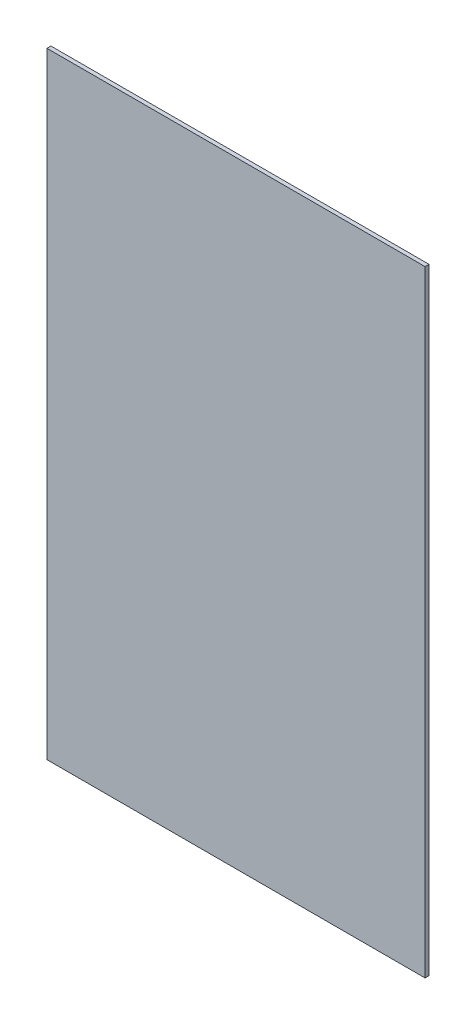
ISO-10303-21;
HEADER;
FILE_DESCRIPTION(('STEP AP214'),'2;1');
FILE_NAME('part.step','',(''),(''),'','','');
FILE_SCHEMA(('AUTOMOTIVE_DESIGN { 1 0 10303 214 1 1 1 1 }'));
ENDSEC;
DATA;
#1=APPLICATION_CONTEXT('core data for automotive mechanical design processes');
#2=APPLICATION_PROTOCOL_DEFINITION('international standard','automotive_design',2000,#1);
#3=PRODUCT_CONTEXT('',#1,'mechanical');
#4=PRODUCT('Part','Part','',(#3));
#5=PRODUCT_RELATED_PRODUCT_CATEGORY('part','',(#4));
#6=PRODUCT_DEFINITION_FORMATION('','',#4);
#7=PRODUCT_DEFINITION_CONTEXT('part definition',#1,'design');
#8=PRODUCT_DEFINITION('design','',#6,#7);
#9=PRODUCT_DEFINITION_SHAPE('','',#8);
#10=(LENGTH_UNIT() NAMED_UNIT(*) SI_UNIT(.MILLI.,.METRE.));
#11=(NAMED_UNIT(*) PLANE_ANGLE_UNIT() SI_UNIT($,.RADIAN.));
#12=(NAMED_UNIT(*) SI_UNIT($,.STERADIAN.) SOLID_ANGLE_UNIT());
#13=UNCERTAINTY_MEASURE_WITH_UNIT(LENGTH_MEASURE(1.E-05),#10,'distance_accuracy_value','');
#14=(GEOMETRIC_REPRESENTATION_CONTEXT(3) GLOBAL_UNCERTAINTY_ASSIGNED_CONTEXT((#13)) GLOBAL_UNIT_ASSIGNED_CONTEXT((#10,
#11,#12)) REPRESENTATION_CONTEXT('',''));
#15=CARTESIAN_POINT('',(0.,0.,0.));
#16=DIRECTION('',(0.,0.,1.));
#17=DIRECTION('',(1.,0.,0.));
#18=AXIS2_PLACEMENT_3D('',#15,#16,#17);
#19=CARTESIAN_POINT('',(-67.5540639585563,66.6562573789846,3.));
#20=DIRECTION('',(1.,0.,0.));
#21=DIRECTION('',(0.,1.,0.));
#22=AXIS2_PLACEMENT_3D('',#19,#20,#21);
#23=PLANE('',#22);
#24=DIRECTION('',(0.,-1.,0.));
#25=VECTOR('',#24,1.);
#26=CARTESIAN_POINT('',(-67.5540639585563,66.6562573789846,0.));
#27=LINE('',#26,#25);
#28=CARTESIAN_POINT('',(-67.5540639585563,66.6562573789846,0.));
#29=VERTEX_POINT('',#28);
#30=CARTESIAN_POINT('',(-67.5540639585562,-399.343742621015,0.));
#31=VERTEX_POINT('',#30);
#32=EDGE_CURVE('E96',#29,#31,#27,.T.);
#33=ORIENTED_EDGE('',*,*,#32,.T.);
#34=DIRECTION('',(0.,0.,-1.));
#35=VECTOR('',#34,1.);
#36=CARTESIAN_POINT('',(-67.5540639585562,-399.343742621015,3.));
#37=LINE('',#36,#35);
#38=CARTESIAN_POINT('',(-67.5540639585562,-399.343742621015,3.));
#39=VERTEX_POINT('',#38);
#40=EDGE_CURVE('E11',#39,#31,#37,.T.);
#41=ORIENTED_EDGE('',*,*,#40,.F.);
#42=DIRECTION('',(0.,-1.,0.));
#43=VECTOR('',#42,1.);
#44=CARTESIAN_POINT('',(-67.5540639585563,66.6562573789846,3.));
#45=LINE('',#44,#43);
#46=CARTESIAN_POINT('',(-67.5540639585563,66.6562573789846,3.));
#47=VERTEX_POINT('',#46);
#48=EDGE_CURVE('E84',#47,#39,#45,.T.);
#49=ORIENTED_EDGE('',*,*,#48,.F.);
#50=DIRECTION('',(0.,0.,-1.));
#51=VECTOR('',#50,1.);
#52=CARTESIAN_POINT('',(-67.5540639585563,66.6562573789846,3.));
#53=LINE('',#52,#51);
#54=EDGE_CURVE('E92',#47,#29,#53,.T.);
#55=ORIENTED_EDGE('',*,*,#54,.T.);
#56=EDGE_LOOP('',(#33,#41,#49,#55));
#57=FACE_BOUND('',#56,.T.);
#58=ADVANCED_FACE('F33',(#57),#23,.F.);
#59=CARTESIAN_POINT('',(-67.5540639585562,-399.343742621015,3.));
#60=DIRECTION('',(0.,1.,0.));
#61=DIRECTION('',(0.,0.,1.));
#62=AXIS2_PLACEMENT_3D('',#59,#60,#61);
#63=PLANE('',#62);
#64=DIRECTION('',(1.,0.,0.));
#65=VECTOR('',#64,1.);
#66=CARTESIAN_POINT('',(-67.5540639585562,-399.343742621015,0.));
#67=LINE('',#66,#65);
#68=CARTESIAN_POINT('',(218.445936041444,-399.343742621015,0.));
#69=VERTEX_POINT('',#68);
#70=EDGE_CURVE('E88',#31,#69,#67,.T.);
#71=ORIENTED_EDGE('',*,*,#70,.T.);
#72=DIRECTION('',(0.,0.,-1.));
#73=VECTOR('',#72,1.);
#74=CARTESIAN_POINT('',(218.445936041444,-399.343742621015,3.));
#75=LINE('',#74,#73);
#76=CARTESIAN_POINT('',(218.445936041444,-399.343742621015,3.));
#77=VERTEX_POINT('',#76);
#78=EDGE_CURVE('E41',#77,#69,#75,.T.);
#79=ORIENTED_EDGE('',*,*,#78,.F.);
#80=DIRECTION('',(1.,0.,0.));
#81=VECTOR('',#80,1.);
#82=CARTESIAN_POINT('',(-67.5540639585562,-399.343742621015,3.));
#83=LINE('',#82,#81);
#84=EDGE_CURVE('E79',#39,#77,#83,.T.);
#85=ORIENTED_EDGE('',*,*,#84,.F.);
#86=ORIENTED_EDGE('',*,*,#40,.T.);
#87=EDGE_LOOP('',(#71,#79,#85,#86));
#88=FACE_BOUND('',#87,.T.);
#89=ADVANCED_FACE('F87',(#88),#63,.F.);
#90=CARTESIAN_POINT('',(218.445936041444,66.6562573789846,3.));
#91=DIRECTION('',(-1.,0.,0.));
#92=DIRECTION('',(0.,-1.,0.));
#93=AXIS2_PLACEMENT_3D('',#90,#91,#92);
#94=PLANE('',#93);
#95=DIRECTION('',(0.,1.,0.));
#96=VECTOR('',#95,1.);
#97=CARTESIAN_POINT('',(218.445936041444,66.6562573789846,0.));
#98=LINE('',#97,#96);
#99=CARTESIAN_POINT('',(218.445936041444,66.6562573789846,0.));
#100=VERTEX_POINT('',#99);
#101=EDGE_CURVE('E66',#69,#100,#98,.T.);
#102=ORIENTED_EDGE('',*,*,#101,.T.);
#103=DIRECTION('',(0.,0.,-1.));
#104=VECTOR('',#103,1.);
#105=CARTESIAN_POINT('',(218.445936041444,66.6562573789846,3.));
#106=LINE('',#105,#104);
#107=CARTESIAN_POINT('',(218.445936041444,66.6562573789846,3.));
#108=VERTEX_POINT('',#107);
#109=EDGE_CURVE('E89',#108,#100,#106,.T.);
#110=ORIENTED_EDGE('',*,*,#109,.F.);
#111=DIRECTION('',(0.,1.,0.));
#112=VECTOR('',#111,1.);
#113=CARTESIAN_POINT('',(218.445936041444,66.6562573789846,3.));
#114=LINE('',#113,#112);
#115=EDGE_CURVE('E82',#77,#108,#114,.T.);
#116=ORIENTED_EDGE('',*,*,#115,.F.);
#117=ORIENTED_EDGE('',*,*,#78,.T.);
#118=EDGE_LOOP('',(#102,#110,#116,#117));
#119=FACE_BOUND('',#118,.T.);
#120=ADVANCED_FACE('F90',(#119),#94,.F.);
#121=CARTESIAN_POINT('',(-67.5540639585563,66.6562573789846,3.));
#122=DIRECTION('',(0.,-1.,0.));
#123=DIRECTION('',(0.,0.,-1.));
#124=AXIS2_PLACEMENT_3D('',#121,#122,#123);
#125=PLANE('',#124);
#126=DIRECTION('',(-1.,0.,0.));
#127=VECTOR('',#126,1.);
#128=CARTESIAN_POINT('',(-67.5540639585563,66.6562573789846,0.));
#129=LINE('',#128,#127);
#130=EDGE_CURVE('E72',#100,#29,#129,.T.);
#131=ORIENTED_EDGE('',*,*,#130,.T.);
#132=ORIENTED_EDGE('',*,*,#54,.F.);
#133=DIRECTION('',(-1.,0.,0.));
#134=VECTOR('',#133,1.);
#135=CARTESIAN_POINT('',(-67.5540639585563,66.6562573789846,3.));
#136=LINE('',#135,#134);
#137=EDGE_CURVE('E49',#108,#47,#136,.T.);
#138=ORIENTED_EDGE('',*,*,#137,.F.);
#139=ORIENTED_EDGE('',*,*,#109,.T.);
#140=EDGE_LOOP('',(#131,#132,#138,#139));
#141=FACE_BOUND('',#140,.T.);
#142=ADVANCED_FACE('F103',(#141),#125,.F.);
#143=CARTESIAN_POINT('',(0.,0.,3.));
#144=DIRECTION('',(0.,0.,1.));
#145=DIRECTION('',(1.,0.,0.));
#146=AXIS2_PLACEMENT_3D('',#143,#144,#145);
#147=PLANE('',#146);
#148=ORIENTED_EDGE('',*,*,#48,.T.);
#149=ORIENTED_EDGE('',*,*,#84,.T.);
#150=ORIENTED_EDGE('',*,*,#115,.T.);
#151=ORIENTED_EDGE('',*,*,#137,.T.);
#152=EDGE_LOOP('',(#148,#149,#150,#151));
#153=FACE_BOUND('',#152,.T.);
#154=ADVANCED_FACE('F80',(#153),#147,.T.);
#155=CARTESIAN_POINT('',(0.,0.,0.));
#156=DIRECTION('',(0.,0.,1.));
#157=DIRECTION('',(1.,0.,0.));
#158=AXIS2_PLACEMENT_3D('',#155,#156,#157);
#159=PLANE('',#158);
#160=ORIENTED_EDGE('',*,*,#32,.F.);
#161=ORIENTED_EDGE('',*,*,#130,.F.);
#162=ORIENTED_EDGE('',*,*,#101,.F.);
#163=ORIENTED_EDGE('',*,*,#70,.F.);
#164=EDGE_LOOP('',(#160,#161,#162,#163));
#165=FACE_BOUND('',#164,.T.);
#166=ADVANCED_FACE('F106',(#165),#159,.F.);
#167=CLOSED_SHELL('',(#58,#89,#120,#142,#154,#166));
#168=MANIFOLD_SOLID_BREP('B2',#167);
#169=ADVANCED_BREP_SHAPE_REPRESENTATION('',(#18,#168),#14);
#170=SHAPE_DEFINITION_REPRESENTATION(#9,#169);
ENDSEC;
END-ISO-10303-21;
